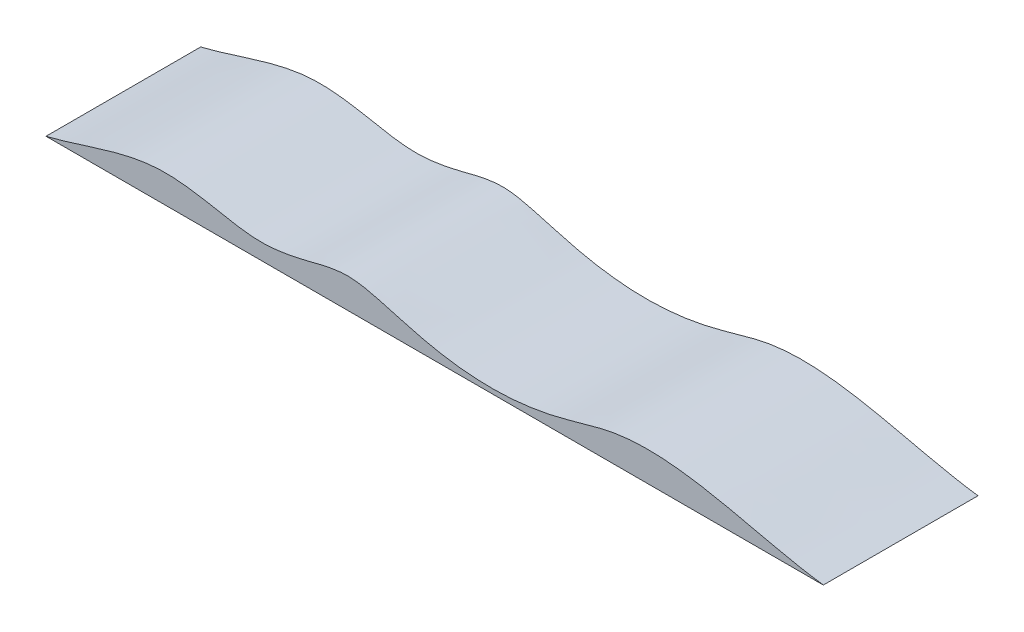
ISO-10303-21;
HEADER;
FILE_DESCRIPTION(('STEP AP214'),'2;1');
FILE_NAME('part.step','',(''),(''),'','','');
FILE_SCHEMA(('AUTOMOTIVE_DESIGN { 1 0 10303 214 1 1 1 1 }'));
ENDSEC;
DATA;
#1=APPLICATION_CONTEXT('core data for automotive mechanical design processes');
#2=APPLICATION_PROTOCOL_DEFINITION('international standard','automotive_design',2000,#1);
#3=PRODUCT_CONTEXT('',#1,'mechanical');
#4=PRODUCT('Part','Part','',(#3));
#5=PRODUCT_RELATED_PRODUCT_CATEGORY('part','',(#4));
#6=PRODUCT_DEFINITION_FORMATION('','',#4);
#7=PRODUCT_DEFINITION_CONTEXT('part definition',#1,'design');
#8=PRODUCT_DEFINITION('design','',#6,#7);
#9=PRODUCT_DEFINITION_SHAPE('','',#8);
#10=(LENGTH_UNIT() NAMED_UNIT(*) SI_UNIT(.MILLI.,.METRE.));
#11=(NAMED_UNIT(*) PLANE_ANGLE_UNIT() SI_UNIT($,.RADIAN.));
#12=(NAMED_UNIT(*) SI_UNIT($,.STERADIAN.) SOLID_ANGLE_UNIT());
#13=UNCERTAINTY_MEASURE_WITH_UNIT(LENGTH_MEASURE(1.E-05),#10,'distance_accuracy_value','');
#14=(GEOMETRIC_REPRESENTATION_CONTEXT(3) GLOBAL_UNCERTAINTY_ASSIGNED_CONTEXT((#13)) GLOBAL_UNIT_ASSIGNED_CONTEXT((#10,
#11,#12)) REPRESENTATION_CONTEXT('',''));
#15=CARTESIAN_POINT('',(0.,0.,0.));
#16=DIRECTION('',(0.,0.,1.));
#17=DIRECTION('',(1.,0.,0.));
#18=AXIS2_PLACEMENT_3D('',#15,#16,#17);
#19=CARTESIAN_POINT('',(-275.27818408,-25.7830424956801,125.));
#20=CARTESIAN_POINT('',(-214.842189299062,-11.3044224465245,125.));
#21=CARTESIAN_POINT('',(-126.437229665996,29.8526199085273,125.));
#22=CARTESIAN_POINT('',(-8.98967591199325,12.2788388965084,125.));
#23=CARTESIAN_POINT('',(68.9854311838519,-5.34271970937216,125.));
#24=CARTESIAN_POINT('',(143.445044402325,8.81052713094579,125.));
#25=CARTESIAN_POINT('',(206.934674698457,27.7152826742818,125.));
#26=CARTESIAN_POINT('',(270.543218903316,12.9797003214857,125.));
#27=CARTESIAN_POINT('',(345.303429456721,-10.141685603276,125.));
#28=CARTESIAN_POINT('',(444.099083616448,-23.0301146111726,125.));
#29=CARTESIAN_POINT('',(548.256173338669,-9.59032237259505,125.));
#30=CARTESIAN_POINT('',(721.212653193598,50.3804349364779,125.));
#31=CARTESIAN_POINT('',(872.026456766299,-11.2658603760843,125.));
#32=CARTESIAN_POINT('',(981.04880688,-25.7830424956801,125.));
#33=B_SPLINE_CURVE_WITH_KNOTS('',3,(#19,#20,#21,#22,#23,#24,#25,#26,#27,#28,#29,#30,#31,#32),
.UNSPECIFIED.,.F.,.F.,(4,1,1,1,1,1,1,1,1,1,1,4),(0.,0.150155665837979,0.213515857175272,
0.276280051940879,0.335933584856105,0.38967227897456,0.428665547466989,0.486345427249086,
0.574789701494016,0.659788448398918,0.731421321001916,1.),.UNSPECIFIED.);
#34=DIRECTION('',(0.,0.,-1.));
#35=VECTOR('',#34,1.);
#36=SURFACE_OF_LINEAR_EXTRUSION('',#33,#35);
#37=CARTESIAN_POINT('',(-275.27818408,-25.7830424956801,-125.));
#38=CARTESIAN_POINT('',(-214.842189299062,-11.3044224465245,-125.));
#39=CARTESIAN_POINT('',(-126.437229665996,29.8526199085273,-125.));
#40=CARTESIAN_POINT('',(-8.98967591199325,12.2788388965084,-125.));
#41=CARTESIAN_POINT('',(68.9854311838519,-5.34271970937216,-125.));
#42=CARTESIAN_POINT('',(143.445044402325,8.81052713094579,-125.));
#43=CARTESIAN_POINT('',(206.934674698457,27.7152826742818,-125.));
#44=CARTESIAN_POINT('',(270.543218903316,12.9797003214857,-125.));
#45=CARTESIAN_POINT('',(345.303429456721,-10.141685603276,-125.));
#46=CARTESIAN_POINT('',(444.099083616448,-23.0301146111726,-125.));
#47=CARTESIAN_POINT('',(548.256173338669,-9.59032237259505,-125.));
#48=CARTESIAN_POINT('',(721.212653193598,50.3804349364779,-125.));
#49=CARTESIAN_POINT('',(872.026456766299,-11.2658603760843,-125.));
#50=CARTESIAN_POINT('',(981.04880688,-25.7830424956801,-125.));
#51=B_SPLINE_CURVE_WITH_KNOTS('',3,(#37,#38,#39,#40,#41,#42,#43,#44,#45,#46,#47,#48,#49,#50),
.UNSPECIFIED.,.F.,.F.,(4,1,1,1,1,1,1,1,1,1,1,4),(0.,0.150155665837979,0.213515857175272,
0.276280051940879,0.335933584856105,0.38967227897456,0.428665547466989,0.486345427249086,
0.574789701494016,0.659788448398918,0.731421321001916,1.),.UNSPECIFIED.);
#52=CARTESIAN_POINT('',(-275.27818408,-25.7830424956801,-125.));
#53=VERTEX_POINT('',#52);
#54=CARTESIAN_POINT('',(981.04880688,-25.7830424956801,-125.));
#55=VERTEX_POINT('',#54);
#56=EDGE_CURVE('E72',#53,#55,#51,.T.);
#57=ORIENTED_EDGE('',*,*,#56,.F.);
#58=DIRECTION('',(0.,0.,-1.));
#59=VECTOR('',#58,1.);
#60=CARTESIAN_POINT('',(-275.27818408,-25.7830424956801,125.));
#61=LINE('',#60,#59);
#62=CARTESIAN_POINT('',(-275.27818408,-25.7830424956801,125.));
#63=VERTEX_POINT('',#62);
#64=EDGE_CURVE('E11',#63,#53,#61,.T.);
#65=ORIENTED_EDGE('',*,*,#64,.F.);
#66=CARTESIAN_POINT('',(981.04880688,-25.7830424956801,125.));
#67=VERTEX_POINT('',#66);
#68=EDGE_CURVE('E74',#63,#67,#33,.T.);
#69=ORIENTED_EDGE('',*,*,#68,.T.);
#70=DIRECTION('',(0.,0.,-1.));
#71=VECTOR('',#70,1.);
#72=CARTESIAN_POINT('',(981.04880688,-25.7830424956801,125.));
#73=LINE('',#72,#71);
#74=EDGE_CURVE('E43',#67,#55,#73,.T.);
#75=ORIENTED_EDGE('',*,*,#74,.T.);
#76=EDGE_LOOP('',(#57,#65,#69,#75));
#77=FACE_BOUND('',#76,.T.);
#78=ADVANCED_FACE('F39',(#77),#36,.T.);
#79=CARTESIAN_POINT('',(-275.27818408,-25.7830424956801,125.));
#80=DIRECTION('',(0.,1.,0.));
#81=DIRECTION('',(0.,0.,1.));
#82=AXIS2_PLACEMENT_3D('',#79,#80,#81);
#83=PLANE('',#82);
#84=DIRECTION('',(1.,0.,0.));
#85=VECTOR('',#84,1.);
#86=CARTESIAN_POINT('',(-275.27818408,-25.7830424956801,-125.));
#87=LINE('',#86,#85);
#88=EDGE_CURVE('E66',#53,#55,#87,.T.);
#89=ORIENTED_EDGE('',*,*,#88,.T.);
#90=ORIENTED_EDGE('',*,*,#74,.F.);
#91=DIRECTION('',(1.,0.,0.));
#92=VECTOR('',#91,1.);
#93=CARTESIAN_POINT('',(-275.27818408,-25.7830424956801,125.));
#94=LINE('',#93,#92);
#95=EDGE_CURVE('E68',#63,#67,#94,.T.);
#96=ORIENTED_EDGE('',*,*,#95,.F.);
#97=ORIENTED_EDGE('',*,*,#64,.T.);
#98=EDGE_LOOP('',(#89,#90,#96,#97));
#99=FACE_BOUND('',#98,.T.);
#100=ADVANCED_FACE('F65',(#99),#83,.F.);
#101=CARTESIAN_POINT('',(350.426943619501,-8.4541773638745,125.));
#102=DIRECTION('',(0.,0.,-1.));
#103=DIRECTION('',(-1.,0.,0.));
#104=AXIS2_PLACEMENT_3D('',#101,#102,#103);
#105=PLANE('',#104);
#106=ORIENTED_EDGE('',*,*,#68,.F.);
#107=ORIENTED_EDGE('',*,*,#95,.T.);
#108=EDGE_LOOP('',(#106,#107));
#109=FACE_BOUND('',#108,.T.);
#110=ADVANCED_FACE('F93',(#109),#105,.F.);
#111=CARTESIAN_POINT('',(350.426943619501,-8.4541773638745,-125.));
#112=DIRECTION('',(0.,0.,-1.));
#113=DIRECTION('',(-1.,0.,0.));
#114=AXIS2_PLACEMENT_3D('',#111,#112,#113);
#115=PLANE('',#114);
#116=ORIENTED_EDGE('',*,*,#56,.T.);
#117=ORIENTED_EDGE('',*,*,#88,.F.);
#118=EDGE_LOOP('',(#116,#117));
#119=FACE_BOUND('',#118,.T.);
#120=ADVANCED_FACE('F71',(#119),#115,.T.);
#121=CLOSED_SHELL('',(#78,#100,#110,#120));
#122=MANIFOLD_SOLID_BREP('B2',#121);
#123=ADVANCED_BREP_SHAPE_REPRESENTATION('',(#18,#122),#14);
#124=SHAPE_DEFINITION_REPRESENTATION(#9,#123);
ENDSEC;
END-ISO-10303-21;
